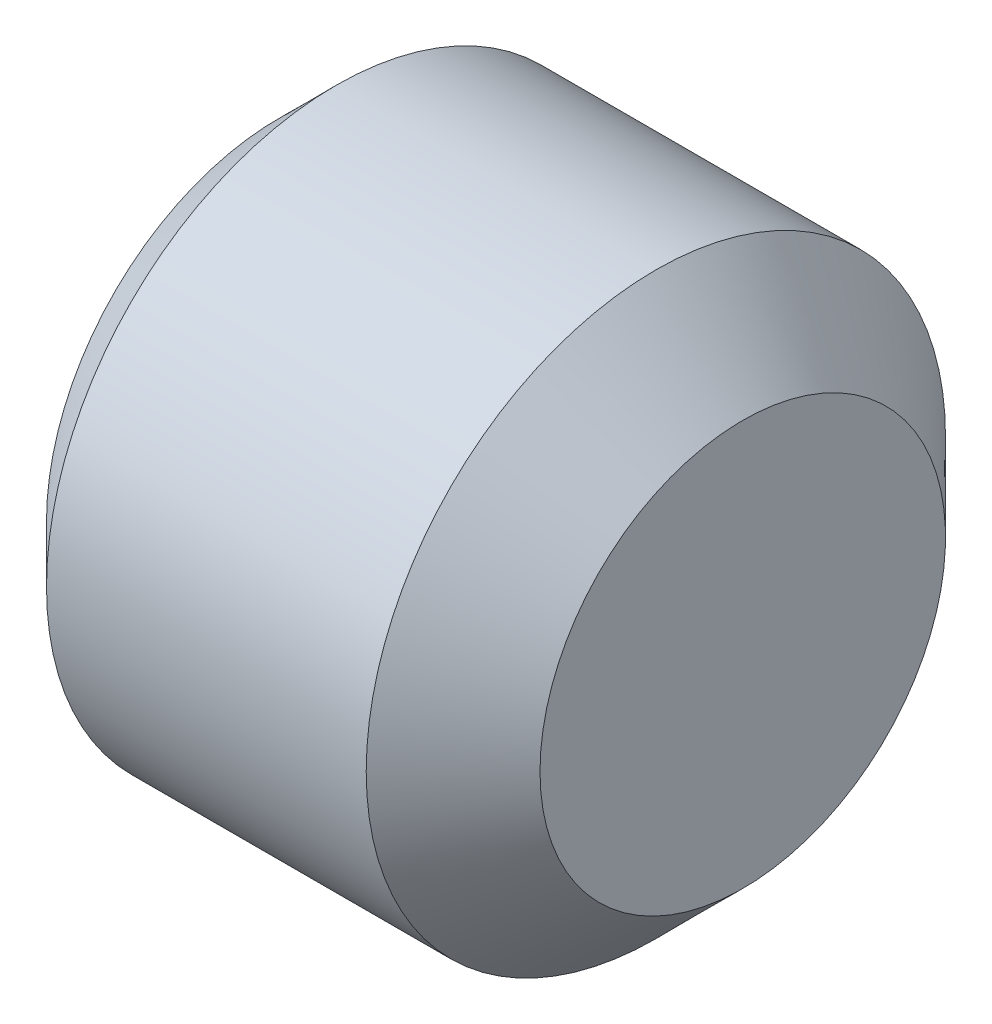
ISO-10303-21;
HEADER;
FILE_DESCRIPTION(('STEP AP214'),'2;1');
FILE_NAME('part.step','',(''),(''),'','','');
FILE_SCHEMA(('AUTOMOTIVE_DESIGN { 1 0 10303 214 1 1 1 1 }'));
ENDSEC;
DATA;
#1=APPLICATION_CONTEXT('core data for automotive mechanical design processes');
#2=APPLICATION_PROTOCOL_DEFINITION('international standard','automotive_design',2000,#1);
#3=PRODUCT_CONTEXT('',#1,'mechanical');
#4=PRODUCT('Part','Part','',(#3));
#5=PRODUCT_RELATED_PRODUCT_CATEGORY('part','',(#4));
#6=PRODUCT_DEFINITION_FORMATION('','',#4);
#7=PRODUCT_DEFINITION_CONTEXT('part definition',#1,'design');
#8=PRODUCT_DEFINITION('design','',#6,#7);
#9=PRODUCT_DEFINITION_SHAPE('','',#8);
#10=(LENGTH_UNIT() NAMED_UNIT(*) SI_UNIT(.MILLI.,.METRE.));
#11=(NAMED_UNIT(*) PLANE_ANGLE_UNIT() SI_UNIT($,.RADIAN.));
#12=(NAMED_UNIT(*) SI_UNIT($,.STERADIAN.) SOLID_ANGLE_UNIT());
#13=UNCERTAINTY_MEASURE_WITH_UNIT(LENGTH_MEASURE(1.E-05),#10,'distance_accuracy_value','');
#14=(GEOMETRIC_REPRESENTATION_CONTEXT(3) GLOBAL_UNCERTAINTY_ASSIGNED_CONTEXT((#13)) GLOBAL_UNIT_ASSIGNED_CONTEXT((#10,
#11,#12)) REPRESENTATION_CONTEXT('',''));
#15=CARTESIAN_POINT('',(0.,0.,0.));
#16=DIRECTION('',(0.,0.,1.));
#17=DIRECTION('',(1.,0.,0.));
#18=AXIS2_PLACEMENT_3D('',#15,#16,#17);
#19=CARTESIAN_POINT('',(-2.,0.,0.));
#20=DIRECTION('',(-1.,0.,0.));
#21=DIRECTION('',(0.,0.,1.));
#22=AXIS2_PLACEMENT_3D('',#19,#20,#21);
#23=PLANE('',#22);
#24=CARTESIAN_POINT('',(-2.,0.,0.));
#25=DIRECTION('',(-1.,0.,0.));
#26=DIRECTION('',(0.,0.,1.));
#27=AXIS2_PLACEMENT_3D('',#24,#25,#26);
#28=CIRCLE('',#27,1.25);
#29=CARTESIAN_POINT('',(-2.,0.625000000000025,1.08253175473053));
#30=VERTEX_POINT('',#29);
#31=CARTESIAN_POINT('',(-2.,1.25,0.));
#32=VERTEX_POINT('',#31);
#33=EDGE_CURVE('E46',#30,#32,#28,.T.);
#34=ORIENTED_EDGE('',*,*,#33,.F.);
#35=DIRECTION('',(0.,0.866025403784427,-0.50000000000002));
#36=VECTOR('',#35,1.);
#37=CARTESIAN_POINT('',(-2.,0.,1.4433756729741));
#38=LINE('',#37,#36);
#39=CARTESIAN_POINT('',(-2.,1.25,0.72168783648703));
#40=VERTEX_POINT('',#39);
#41=EDGE_CURVE('E229',#30,#40,#38,.T.);
#42=ORIENTED_EDGE('',*,*,#41,.T.);
#43=DIRECTION('',(0.,0.,-1.));
#44=VECTOR('',#43,1.);
#45=CARTESIAN_POINT('',(-2.,1.25,0.72168783648703));
#46=LINE('',#45,#44);
#47=EDGE_CURVE('E222',#40,#32,#46,.T.);
#48=ORIENTED_EDGE('',*,*,#47,.T.);
#49=EDGE_LOOP('',(#34,#42,#48));
#50=FACE_BOUND('',#49,.T.);
#51=ADVANCED_FACE('F35',(#50),#23,.T.);
#52=CARTESIAN_POINT('',(-2.,0.625000000000025,-1.08253175473053));
#53=VERTEX_POINT('',#52);
#54=EDGE_CURVE('E11',#32,#53,#28,.T.);
#55=ORIENTED_EDGE('',*,*,#54,.F.);
#56=CARTESIAN_POINT('',(-2.,1.25,-0.72168783648703));
#57=VERTEX_POINT('',#56);
#58=EDGE_CURVE('E225',#32,#57,#46,.T.);
#59=ORIENTED_EDGE('',*,*,#58,.T.);
#60=DIRECTION('',(0.,-0.866025403784427,-0.50000000000002));
#61=VECTOR('',#60,1.);
#62=CARTESIAN_POINT('',(-2.,1.25,-0.72168783648703));
#63=LINE('',#62,#61);
#64=EDGE_CURVE('E218',#57,#53,#63,.T.);
#65=ORIENTED_EDGE('',*,*,#64,.T.);
#66=EDGE_LOOP('',(#55,#59,#65));
#67=FACE_BOUND('',#66,.T.);
#68=ADVANCED_FACE('F122',(#67),#23,.T.);
#69=CARTESIAN_POINT('',(-2.,-0.625000000000025,-1.08253175473053));
#70=VERTEX_POINT('',#69);
#71=EDGE_CURVE('E44',#53,#70,#28,.T.);
#72=ORIENTED_EDGE('',*,*,#71,.F.);
#73=CARTESIAN_POINT('',(-2.,0.,-1.4433756729741));
#74=VERTEX_POINT('',#73);
#75=EDGE_CURVE('E221',#53,#74,#63,.T.);
#76=ORIENTED_EDGE('',*,*,#75,.T.);
#77=DIRECTION('',(0.,-0.866025403784427,0.50000000000002));
#78=VECTOR('',#77,1.);
#79=CARTESIAN_POINT('',(-2.,0.,-1.4433756729741));
#80=LINE('',#79,#78);
#81=EDGE_CURVE('E189',#74,#70,#80,.T.);
#82=ORIENTED_EDGE('',*,*,#81,.T.);
#83=EDGE_LOOP('',(#72,#76,#82));
#84=FACE_BOUND('',#83,.T.);
#85=ADVANCED_FACE('F127',(#84),#23,.T.);
#86=CARTESIAN_POINT('',(-2.,-1.25,0.));
#87=VERTEX_POINT('',#86);
#88=EDGE_CURVE('E237',#70,#87,#28,.T.);
#89=ORIENTED_EDGE('',*,*,#88,.F.);
#90=CARTESIAN_POINT('',(-2.,-1.25,-0.72168783648703));
#91=VERTEX_POINT('',#90);
#92=EDGE_CURVE('E217',#70,#91,#80,.T.);
#93=ORIENTED_EDGE('',*,*,#92,.T.);
#94=DIRECTION('',(0.,0.,1.));
#95=VECTOR('',#94,1.);
#96=CARTESIAN_POINT('',(-2.,-1.25,-0.72168783648703));
#97=LINE('',#96,#95);
#98=EDGE_CURVE('E234',#91,#87,#97,.T.);
#99=ORIENTED_EDGE('',*,*,#98,.T.);
#100=EDGE_LOOP('',(#89,#93,#99));
#101=FACE_BOUND('',#100,.T.);
#102=ADVANCED_FACE('F244',(#101),#23,.T.);
#103=CARTESIAN_POINT('',(-2.,-0.625000000000032,1.08253175473055));
#104=VERTEX_POINT('',#103);
#105=EDGE_CURVE('E53',#87,#104,#28,.T.);
#106=ORIENTED_EDGE('',*,*,#105,.F.);
#107=CARTESIAN_POINT('',(-2.,-1.25,0.72168783648703));
#108=VERTEX_POINT('',#107);
#109=EDGE_CURVE('E201',#87,#108,#97,.T.);
#110=ORIENTED_EDGE('',*,*,#109,.T.);
#111=DIRECTION('',(0.,0.866025403784427,0.50000000000002));
#112=VECTOR('',#111,1.);
#113=CARTESIAN_POINT('',(-2.,-1.25,0.72168783648703));
#114=LINE('',#113,#112);
#115=EDGE_CURVE('E230',#108,#104,#114,.T.);
#116=ORIENTED_EDGE('',*,*,#115,.T.);
#117=EDGE_LOOP('',(#106,#110,#116));
#118=FACE_BOUND('',#117,.T.);
#119=ADVANCED_FACE('F120',(#118),#23,.T.);
#120=CARTESIAN_POINT('',(-4.,0.,0.));
#121=DIRECTION('',(1.,0.,0.));
#122=DIRECTION('',(0.,0.,-1.));
#123=AXIS2_PLACEMENT_3D('',#120,#121,#122);
#124=PLANE('',#123);
#125=DIRECTION('',(0.,0.866025403784427,0.50000000000002));
#126=VECTOR('',#125,1.);
#127=CARTESIAN_POINT('',(-4.,-1.25,0.72168783648703));
#128=LINE('',#127,#126);
#129=CARTESIAN_POINT('',(-4.,-1.25,0.72168783648703));
#130=VERTEX_POINT('',#129);
#131=CARTESIAN_POINT('',(-4.,0.,1.4433756729741));
#132=VERTEX_POINT('',#131);
#133=EDGE_CURVE('E211',#130,#132,#128,.T.);
#134=ORIENTED_EDGE('',*,*,#133,.F.);
#135=DIRECTION('',(0.,0.,1.));
#136=VECTOR('',#135,1.);
#137=CARTESIAN_POINT('',(-4.,-1.25,-0.72168783648703));
#138=LINE('',#137,#136);
#139=CARTESIAN_POINT('',(-4.,-1.25,-0.72168783648703));
#140=VERTEX_POINT('',#139);
#141=EDGE_CURVE('E61',#140,#130,#138,.T.);
#142=ORIENTED_EDGE('',*,*,#141,.F.);
#143=DIRECTION('',(0.,-0.866025403784427,0.50000000000002));
#144=VECTOR('',#143,1.);
#145=CARTESIAN_POINT('',(-4.,0.,-1.4433756729741));
#146=LINE('',#145,#144);
#147=CARTESIAN_POINT('',(-4.,0.,-1.4433756729741));
#148=VERTEX_POINT('',#147);
#149=EDGE_CURVE('E198',#148,#140,#146,.T.);
#150=ORIENTED_EDGE('',*,*,#149,.F.);
#151=DIRECTION('',(0.,-0.866025403784427,-0.50000000000002));
#152=VECTOR('',#151,1.);
#153=CARTESIAN_POINT('',(-4.,1.25,-0.72168783648703));
#154=LINE('',#153,#152);
#155=CARTESIAN_POINT('',(-4.,1.25,-0.72168783648703));
#156=VERTEX_POINT('',#155);
#157=EDGE_CURVE('E202',#156,#148,#154,.T.);
#158=ORIENTED_EDGE('',*,*,#157,.F.);
#159=DIRECTION('',(0.,0.,-1.));
#160=VECTOR('',#159,1.);
#161=CARTESIAN_POINT('',(-4.,1.25,0.72168783648703));
#162=LINE('',#161,#160);
#163=CARTESIAN_POINT('',(-4.,1.25,0.72168783648703));
#164=VERTEX_POINT('',#163);
#165=EDGE_CURVE('E205',#164,#156,#162,.T.);
#166=ORIENTED_EDGE('',*,*,#165,.F.);
#167=DIRECTION('',(0.,0.866025403784427,-0.50000000000002));
#168=VECTOR('',#167,1.);
#169=CARTESIAN_POINT('',(-4.,0.,1.4433756729741));
#170=LINE('',#169,#168);
#171=EDGE_CURVE('E208',#132,#164,#170,.T.);
#172=ORIENTED_EDGE('',*,*,#171,.F.);
#173=EDGE_LOOP('',(#134,#142,#150,#158,#166,#172));
#174=FACE_BOUND('',#173,.T.);
#175=CARTESIAN_POINT('',(-4.,0.,0.));
#176=DIRECTION('',(-1.,0.,0.));
#177=DIRECTION('',(0.,0.,1.));
#178=AXIS2_PLACEMENT_3D('',#175,#176,#177);
#179=CIRCLE('',#178,2.0095);
#180=CARTESIAN_POINT('',(-4.,0.,2.0095));
#181=VERTEX_POINT('',#180);
#182=EDGE_CURVE('E39',#181,#181,#179,.T.);
#183=ORIENTED_EDGE('',*,*,#182,.T.);
#184=EDGE_LOOP('',(#183));
#185=FACE_BOUND('',#184,.T.);
#186=ADVANCED_FACE('F37',(#174,#185),#124,.F.);
#187=CARTESIAN_POINT('',(-3.5095,0.,0.));
#188=DIRECTION('',(1.,0.,0.));
#189=DIRECTION('',(0.,0.,-1.));
#190=AXIS2_PLACEMENT_3D('',#187,#188,#189);
#191=CONICAL_SURFACE('',#190,2.5,0.785398163397448);
#192=ORIENTED_EDGE('',*,*,#182,.F.);
#193=EDGE_LOOP('',(#192));
#194=FACE_BOUND('',#193,.T.);
#195=CARTESIAN_POINT('',(-3.5095,0.,0.));
#196=DIRECTION('',(-1.,0.,0.));
#197=DIRECTION('',(0.,0.,1.));
#198=AXIS2_PLACEMENT_3D('',#195,#196,#197);
#199=CIRCLE('',#198,2.5);
#200=CARTESIAN_POINT('',(-3.5095,0.,2.5));
#201=VERTEX_POINT('',#200);
#202=EDGE_CURVE('E176',#201,#201,#199,.T.);
#203=ORIENTED_EDGE('',*,*,#202,.T.);
#204=EDGE_LOOP('',(#203));
#205=FACE_BOUND('',#204,.T.);
#206=ADVANCED_FACE('F163',(#194,#205),#191,.T.);
#207=CARTESIAN_POINT('',(0.,0.,0.));
#208=DIRECTION('',(-1.,0.,0.));
#209=DIRECTION('',(0.,0.,1.));
#210=AXIS2_PLACEMENT_3D('',#207,#208,#209);
#211=CYLINDRICAL_SURFACE('',#210,2.5);
#212=ORIENTED_EDGE('',*,*,#202,.F.);
#213=EDGE_LOOP('',(#212));
#214=FACE_BOUND('',#213,.T.);
#215=CARTESIAN_POINT('',(-0.75,0.,0.));
#216=DIRECTION('',(-1.,0.,0.));
#217=DIRECTION('',(0.,0.,1.));
#218=AXIS2_PLACEMENT_3D('',#215,#216,#217);
#219=CIRCLE('',#218,2.5);
#220=CARTESIAN_POINT('',(-0.75,0.,2.5));
#221=VERTEX_POINT('',#220);
#222=EDGE_CURVE('E177',#221,#221,#219,.T.);
#223=ORIENTED_EDGE('',*,*,#222,.T.);
#224=EDGE_LOOP('',(#223));
#225=FACE_BOUND('',#224,.T.);
#226=ADVANCED_FACE('F160',(#214,#225),#211,.T.);
#227=CARTESIAN_POINT('',(0.,0.,0.));
#228=DIRECTION('',(-1.,0.,0.));
#229=DIRECTION('',(0.,0.,1.));
#230=AXIS2_PLACEMENT_3D('',#227,#228,#229);
#231=CONICAL_SURFACE('',#230,1.75,0.785398163397448);
#232=ORIENTED_EDGE('',*,*,#222,.F.);
#233=EDGE_LOOP('',(#232));
#234=FACE_BOUND('',#233,.T.);
#235=CARTESIAN_POINT('',(0.,0.,0.));
#236=DIRECTION('',(-1.,0.,0.));
#237=DIRECTION('',(0.,0.,1.));
#238=AXIS2_PLACEMENT_3D('',#235,#236,#237);
#239=CIRCLE('',#238,1.75);
#240=CARTESIAN_POINT('',(0.,0.,1.75));
#241=VERTEX_POINT('',#240);
#242=EDGE_CURVE('E180',#241,#241,#239,.T.);
#243=ORIENTED_EDGE('',*,*,#242,.T.);
#244=EDGE_LOOP('',(#243));
#245=FACE_BOUND('',#244,.T.);
#246=ADVANCED_FACE('F156',(#234,#245),#231,.T.);
#247=CARTESIAN_POINT('',(0.,1.75,0.));
#248=DIRECTION('',(-1.,0.,0.));
#249=DIRECTION('',(0.,0.,1.));
#250=AXIS2_PLACEMENT_3D('',#247,#248,#249);
#251=PLANE('',#250);
#252=ORIENTED_EDGE('',*,*,#242,.F.);
#253=EDGE_LOOP('',(#252));
#254=FACE_BOUND('',#253,.T.);
#255=ADVANCED_FACE('F153',(#254),#251,.F.);
#256=CARTESIAN_POINT('',(-2.,-1.25,-0.72168783648703));
#257=DIRECTION('',(0.,-1.,0.));
#258=DIRECTION('',(0.,0.,-1.));
#259=AXIS2_PLACEMENT_3D('',#256,#257,#258);
#260=PLANE('',#259);
#261=ORIENTED_EDGE('',*,*,#141,.T.);
#262=DIRECTION('',(-1.,0.,0.));
#263=VECTOR('',#262,1.);
#264=CARTESIAN_POINT('',(-2.,-1.25,0.72168783648703));
#265=LINE('',#264,#263);
#266=EDGE_CURVE('E186',#108,#130,#265,.T.);
#267=ORIENTED_EDGE('',*,*,#266,.F.);
#268=ORIENTED_EDGE('',*,*,#109,.F.);
#269=ORIENTED_EDGE('',*,*,#98,.F.);
#270=DIRECTION('',(-1.,0.,0.));
#271=VECTOR('',#270,1.);
#272=CARTESIAN_POINT('',(-2.,-1.25,-0.72168783648703));
#273=LINE('',#272,#271);
#274=EDGE_CURVE('E185',#91,#140,#273,.T.);
#275=ORIENTED_EDGE('',*,*,#274,.T.);
#276=EDGE_LOOP('',(#261,#267,#268,#269,#275));
#277=FACE_BOUND('',#276,.T.);
#278=ADVANCED_FACE('F135',(#277),#260,.F.);
#279=CARTESIAN_POINT('',(-2.,0.,-1.4433756729741));
#280=DIRECTION('',(0.,-0.50000000000002,-0.866025403784427));
#281=DIRECTION('',(0.,0.866025403784427,-0.50000000000002));
#282=AXIS2_PLACEMENT_3D('',#279,#280,#281);
#283=PLANE('',#282);
#284=ORIENTED_EDGE('',*,*,#149,.T.);
#285=ORIENTED_EDGE('',*,*,#274,.F.);
#286=ORIENTED_EDGE('',*,*,#92,.F.);
#287=ORIENTED_EDGE('',*,*,#81,.F.);
#288=DIRECTION('',(-1.,0.,0.));
#289=VECTOR('',#288,1.);
#290=CARTESIAN_POINT('',(-2.,0.,-1.4433756729741));
#291=LINE('',#290,#289);
#292=EDGE_CURVE('E195',#74,#148,#291,.T.);
#293=ORIENTED_EDGE('',*,*,#292,.T.);
#294=EDGE_LOOP('',(#284,#285,#286,#287,#293));
#295=FACE_BOUND('',#294,.T.);
#296=ADVANCED_FACE('F131',(#295),#283,.F.);
#297=CARTESIAN_POINT('',(-2.,1.25,-0.72168783648703));
#298=DIRECTION('',(0.,0.50000000000002,-0.866025403784427));
#299=DIRECTION('',(0.,0.866025403784427,0.50000000000002));
#300=AXIS2_PLACEMENT_3D('',#297,#298,#299);
#301=PLANE('',#300);
#302=ORIENTED_EDGE('',*,*,#157,.T.);
#303=ORIENTED_EDGE('',*,*,#292,.F.);
#304=ORIENTED_EDGE('',*,*,#75,.F.);
#305=ORIENTED_EDGE('',*,*,#64,.F.);
#306=DIRECTION('',(-1.,0.,0.));
#307=VECTOR('',#306,1.);
#308=CARTESIAN_POINT('',(-2.,1.25,-0.72168783648703));
#309=LINE('',#308,#307);
#310=EDGE_CURVE('E193',#57,#156,#309,.T.);
#311=ORIENTED_EDGE('',*,*,#310,.T.);
#312=EDGE_LOOP('',(#302,#303,#304,#305,#311));
#313=FACE_BOUND('',#312,.T.);
#314=ADVANCED_FACE('F134',(#313),#301,.F.);
#315=CARTESIAN_POINT('',(-2.,1.25,0.72168783648703));
#316=DIRECTION('',(0.,1.,0.));
#317=DIRECTION('',(0.,0.,1.));
#318=AXIS2_PLACEMENT_3D('',#315,#316,#317);
#319=PLANE('',#318);
#320=ORIENTED_EDGE('',*,*,#165,.T.);
#321=ORIENTED_EDGE('',*,*,#310,.F.);
#322=ORIENTED_EDGE('',*,*,#58,.F.);
#323=ORIENTED_EDGE('',*,*,#47,.F.);
#324=DIRECTION('',(-1.,0.,0.));
#325=VECTOR('',#324,1.);
#326=CARTESIAN_POINT('',(-2.,1.25,0.72168783648703));
#327=LINE('',#326,#325);
#328=EDGE_CURVE('E191',#40,#164,#327,.T.);
#329=ORIENTED_EDGE('',*,*,#328,.T.);
#330=EDGE_LOOP('',(#320,#321,#322,#323,#329));
#331=FACE_BOUND('',#330,.T.);
#332=ADVANCED_FACE('F139',(#331),#319,.F.);
#333=CARTESIAN_POINT('',(-2.,0.,1.4433756729741));
#334=DIRECTION('',(0.,0.50000000000002,0.866025403784427));
#335=DIRECTION('',(0.,-0.866025403784427,0.50000000000002));
#336=AXIS2_PLACEMENT_3D('',#333,#334,#335);
#337=PLANE('',#336);
#338=ORIENTED_EDGE('',*,*,#171,.T.);
#339=ORIENTED_EDGE('',*,*,#328,.F.);
#340=ORIENTED_EDGE('',*,*,#41,.F.);
#341=CARTESIAN_POINT('',(-2.,0.,1.4433756729741));
#342=VERTEX_POINT('',#341);
#343=EDGE_CURVE('E226',#342,#30,#38,.T.);
#344=ORIENTED_EDGE('',*,*,#343,.F.);
#345=DIRECTION('',(-1.,0.,0.));
#346=VECTOR('',#345,1.);
#347=CARTESIAN_POINT('',(-2.,0.,1.4433756729741));
#348=LINE('',#347,#346);
#349=EDGE_CURVE('E188',#342,#132,#348,.T.);
#350=ORIENTED_EDGE('',*,*,#349,.T.);
#351=EDGE_LOOP('',(#338,#339,#340,#344,#350));
#352=FACE_BOUND('',#351,.T.);
#353=ADVANCED_FACE('F143',(#352),#337,.F.);
#354=CARTESIAN_POINT('',(-2.,-1.25,0.72168783648703));
#355=DIRECTION('',(0.,-0.50000000000002,0.866025403784427));
#356=DIRECTION('',(0.,-0.866025403784427,-0.50000000000002));
#357=AXIS2_PLACEMENT_3D('',#354,#355,#356);
#358=PLANE('',#357);
#359=ORIENTED_EDGE('',*,*,#133,.T.);
#360=ORIENTED_EDGE('',*,*,#349,.F.);
#361=EDGE_CURVE('E233',#104,#342,#114,.T.);
#362=ORIENTED_EDGE('',*,*,#361,.F.);
#363=ORIENTED_EDGE('',*,*,#115,.F.);
#364=ORIENTED_EDGE('',*,*,#266,.T.);
#365=EDGE_LOOP('',(#359,#360,#362,#363,#364));
#366=FACE_BOUND('',#365,.T.);
#367=ADVANCED_FACE('F117',(#366),#358,.F.);
#368=EDGE_CURVE('E178',#104,#30,#28,.T.);
#369=ORIENTED_EDGE('',*,*,#368,.F.);
#370=ORIENTED_EDGE('',*,*,#361,.T.);
#371=ORIENTED_EDGE('',*,*,#343,.T.);
#372=EDGE_LOOP('',(#369,#370,#371));
#373=FACE_BOUND('',#372,.T.);
#374=ADVANCED_FACE('F112',(#373),#23,.T.);
#375=CARTESIAN_POINT('',(-1.278312163513,0.,0.));
#376=DIRECTION('',(-1.,0.,0.));
#377=DIRECTION('',(0.,0.,1.));
#378=AXIS2_PLACEMENT_3D('',#375,#376,#377);
#379=CONICAL_SURFACE('',#378,0.,1.04719755119662);
#380=ORIENTED_EDGE('',*,*,#33,.T.);
#381=ORIENTED_EDGE('',*,*,#54,.T.);
#382=ORIENTED_EDGE('',*,*,#71,.T.);
#383=ORIENTED_EDGE('',*,*,#88,.T.);
#384=ORIENTED_EDGE('',*,*,#105,.T.);
#385=ORIENTED_EDGE('',*,*,#368,.T.);
#386=EDGE_LOOP('',(#380,#381,#382,#383,#384,#385));
#387=FACE_BOUND('',#386,.T.);
#388=CARTESIAN_POINT('',(-1.278312163513,0.,0.));
#389=VERTEX_POINT('',#388);
#390=VERTEX_LOOP('',#389);
#391=FACE_BOUND('',#390,.T.);
#392=ADVANCED_FACE('F110',(#387,#391),#379,.F.);
#393=CLOSED_SHELL('',(#51,#68,#85,#102,#119,#186,#206,#226,#246,#255,#278,#296,#314,#332,#353,
#367,#374,#392));
#394=MANIFOLD_SOLID_BREP('B2',#393);
#395=ADVANCED_BREP_SHAPE_REPRESENTATION('',(#18,#394),#14);
#396=SHAPE_DEFINITION_REPRESENTATION(#9,#395);
ENDSEC;
END-ISO-10303-21;
